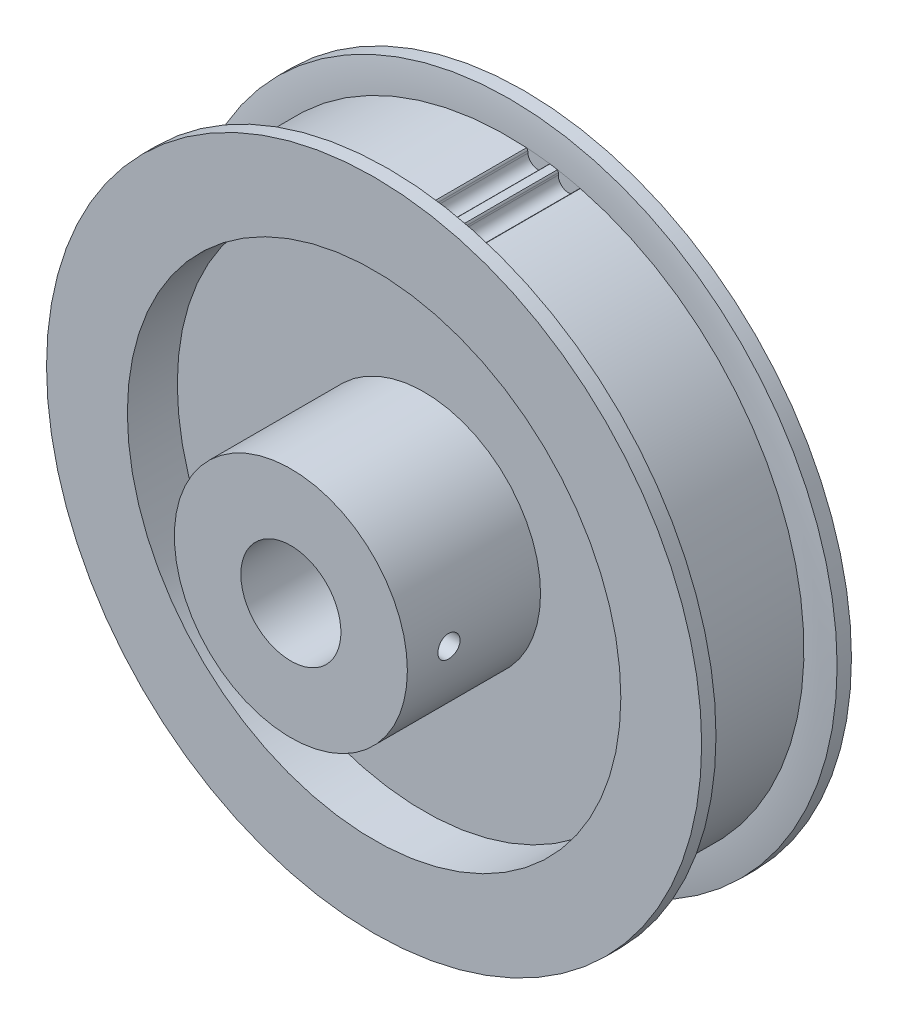
ISO-10303-21;
HEADER;
FILE_DESCRIPTION(('STEP AP214'),'2;1');
FILE_NAME('part.step','',(''),(''),'','','');
FILE_SCHEMA(('AUTOMOTIVE_DESIGN { 1 0 10303 214 1 1 1 1 }'));
ENDSEC;
DATA;
#1=APPLICATION_CONTEXT('core data for automotive mechanical design processes');
#2=APPLICATION_PROTOCOL_DEFINITION('international standard','automotive_design',2000,#1);
#3=PRODUCT_CONTEXT('',#1,'mechanical');
#4=PRODUCT('Part','Part','',(#3));
#5=PRODUCT_RELATED_PRODUCT_CATEGORY('part','',(#4));
#6=PRODUCT_DEFINITION_FORMATION('','',#4);
#7=PRODUCT_DEFINITION_CONTEXT('part definition',#1,'design');
#8=PRODUCT_DEFINITION('design','',#6,#7);
#9=PRODUCT_DEFINITION_SHAPE('','',#8);
#10=(LENGTH_UNIT() NAMED_UNIT(*) SI_UNIT(.MILLI.,.METRE.));
#11=(NAMED_UNIT(*) PLANE_ANGLE_UNIT() SI_UNIT($,.RADIAN.));
#12=(NAMED_UNIT(*) SI_UNIT($,.STERADIAN.) SOLID_ANGLE_UNIT());
#13=UNCERTAINTY_MEASURE_WITH_UNIT(LENGTH_MEASURE(1.E-05),#10,'distance_accuracy_value','');
#14=(GEOMETRIC_REPRESENTATION_CONTEXT(3) GLOBAL_UNCERTAINTY_ASSIGNED_CONTEXT((#13)) GLOBAL_UNIT_ASSIGNED_CONTEXT((#10,
#11,#12)) REPRESENTATION_CONTEXT('',''));
#15=CARTESIAN_POINT('',(0.,0.,0.));
#16=DIRECTION('',(0.,0.,1.));
#17=DIRECTION('',(1.,0.,0.));
#18=AXIS2_PLACEMENT_3D('',#15,#16,#17);
#19=CARTESIAN_POINT('',(0.,0.,15.08125));
#20=DIRECTION('',(0.,0.,-1.));
#21=DIRECTION('',(-1.,0.,0.));
#22=AXIS2_PLACEMENT_3D('',#19,#20,#21);
#23=CYLINDRICAL_SURFACE('',#22,4.76885);
#24=CARTESIAN_POINT('',(0.,0.,15.08125));
#25=DIRECTION('',(0.,0.,-1.));
#26=DIRECTION('',(-1.,0.,0.));
#27=AXIS2_PLACEMENT_3D('',#24,#25,#26);
#28=CIRCLE('',#27,4.76885);
#29=CARTESIAN_POINT('',(-4.76885,0.,15.08125));
#30=VERTEX_POINT('',#29);
#31=EDGE_CURVE('E20',#30,#30,#28,.T.);
#32=ORIENTED_EDGE('',*,*,#31,.F.);
#33=EDGE_LOOP('',(#32));
#34=FACE_BOUND('',#33,.T.);
#35=CARTESIAN_POINT('',(0.,0.,-7.14375));
#36=DIRECTION('',(0.,0.,-1.));
#37=DIRECTION('',(-1.,0.,0.));
#38=AXIS2_PLACEMENT_3D('',#35,#36,#37);
#39=CIRCLE('',#38,4.76885);
#40=CARTESIAN_POINT('',(-4.76885,0.,-7.14375));
#41=VERTEX_POINT('',#40);
#42=EDGE_CURVE('E616',#41,#41,#39,.T.);
#43=ORIENTED_EDGE('',*,*,#42,.T.);
#44=EDGE_LOOP('',(#43));
#45=FACE_BOUND('',#44,.T.);
#46=CARTESIAN_POINT('',(4.76885,0.,12.1708333333334));
#47=CARTESIAN_POINT('',(4.76884847306571,-0.0586123041048064,12.17083044195));
#48=CARTESIAN_POINT('',(4.76775734312836,-0.117295795218659,12.1659430419181));
#49=CARTESIAN_POINT('',(4.76350613938723,-0.2330437076321,12.1465291246467));
#50=CARTESIAN_POINT('',(4.7603420522376,-0.290104763764251,12.1319839086684));
#51=CARTESIAN_POINT('',(4.75229742473407,-0.400844929684411,12.0937325411842));
#52=CARTESIAN_POINT('',(4.74741952972268,-0.454529102128736,12.0700405026863));
#53=CARTESIAN_POINT('',(4.73647435346353,-0.5571418424057,12.0142065699433));
#54=CARTESIAN_POINT('',(4.7304074297014,-0.606071833002247,11.9820672144251));
#55=CARTESIAN_POINT('',(4.71763463518445,-0.698620847249218,11.9096827759978));
#56=CARTESIAN_POINT('',(4.7109205925116,-0.742149896327489,11.8693240760116));
#57=CARTESIAN_POINT('',(4.69766728828876,-0.82188187530551,11.781888529202));
#58=CARTESIAN_POINT('',(4.6911280522598,-0.858083740483086,11.734810707707));
#59=CARTESIAN_POINT('',(4.67888518332514,-0.922526682545571,11.6346126124925));
#60=CARTESIAN_POINT('',(4.67319191418832,-0.950672408242291,11.5814296333453));
#61=CARTESIAN_POINT('',(4.66340206452208,-0.997591991340194,11.4709418717254));
#62=CARTESIAN_POINT('',(4.65930527391939,-1.0163670818716,11.4136376327267));
#63=CARTESIAN_POINT('',(4.65325483593039,-1.04371677040196,11.2975035268964));
#64=CARTESIAN_POINT('',(4.65126796129376,-1.05244970180919,11.238712716185));
#65=CARTESIAN_POINT('',(4.64956255865491,-1.05995957296108,11.1204693760151));
#66=CARTESIAN_POINT('',(4.64984374652198,-1.05873775978254,11.0610169303745));
#67=CARTESIAN_POINT('',(4.65261263193993,-1.04650016245331,10.9443190716094));
#68=CARTESIAN_POINT('',(4.65505876969299,-1.03566883929887,10.8870531788706));
#69=CARTESIAN_POINT('',(4.66181620645629,-1.00481198001847,10.7751717294144));
#70=CARTESIAN_POINT('',(4.6661276262592,-0.984785848446423,10.7205563445944));
#71=CARTESIAN_POINT('',(4.67617067171151,-0.935938960169094,10.6150088795935));
#72=CARTESIAN_POINT('',(4.681913658347,-0.907047401484529,10.5641106924875));
#73=CARTESIAN_POINT('',(4.69416531023992,-0.841341705001432,10.4678204452049));
#74=CARTESIAN_POINT('',(4.70067402857244,-0.804527017880904,10.4224287671439));
#75=CARTESIAN_POINT('',(4.71390095516389,-0.723052709932271,10.3373819616924));
#76=CARTESIAN_POINT('',(4.72062061373945,-0.678237657979727,10.2978758300807));
#77=CARTESIAN_POINT('',(4.73338440331373,-0.582520218827615,10.2268984926627));
#78=CARTESIAN_POINT('',(4.73942824011096,-0.531615200324313,10.1954307785756));
#79=CARTESIAN_POINT('',(4.75018068491062,-0.424963998075343,10.1413864817509));
#80=CARTESIAN_POINT('',(4.75488521292261,-0.369203683150195,10.1188369874257));
#81=CARTESIAN_POINT('',(4.76239148758987,-0.254627675271092,10.0835132015441));
#82=CARTESIAN_POINT('',(4.76519721448175,-0.195818653498635,10.0707184550667));
#83=CARTESIAN_POINT('',(4.76754649622475,-0.113788746429426,10.0600534469669));
#84=CARTESIAN_POINT('',(4.76803417109396,-0.0910930120307624,10.0578478943051));
#85=CARTESIAN_POINT('',(4.7686862203424,-0.0456017778238444,10.0549039403021));
#86=CARTESIAN_POINT('',(4.76885059413613,-0.0228062778349896,10.0541655416179));
#87=CARTESIAN_POINT('',(4.76884847306572,0.0586123041048063,10.05416955805));
#88=CARTESIAN_POINT('',(4.76775734312836,0.117295795218659,10.0590569580819));
#89=CARTESIAN_POINT('',(4.76350613938723,0.233043707632099,10.0784708753533));
#90=CARTESIAN_POINT('',(4.7603420522376,0.290104763764251,10.0930160913316));
#91=CARTESIAN_POINT('',(4.75229742473407,0.400844929684412,10.1312674588158));
#92=CARTESIAN_POINT('',(4.74741952972267,0.454529102128737,10.1549594973137));
#93=CARTESIAN_POINT('',(4.73647435346353,0.557141842405701,10.2107934300567));
#94=CARTESIAN_POINT('',(4.7304074297014,0.606071833002247,10.2429327855749));
#95=CARTESIAN_POINT('',(4.71763463518445,0.698620847249218,10.3153172240022));
#96=CARTESIAN_POINT('',(4.7109205925116,0.742149896327489,10.3556759239884));
#97=CARTESIAN_POINT('',(4.69766728828876,0.82188187530551,10.443111470798));
#98=CARTESIAN_POINT('',(4.6911280522598,0.858083740483086,10.490189292293));
#99=CARTESIAN_POINT('',(4.67888518332514,0.922526682545571,10.5903873875075));
#100=CARTESIAN_POINT('',(4.67319191418832,0.95067240824229,10.6435703666547));
#101=CARTESIAN_POINT('',(4.66340206452208,0.997591991340194,10.7540581282746));
#102=CARTESIAN_POINT('',(4.65930527391939,1.0163670818716,10.8113623672733));
#103=CARTESIAN_POINT('',(4.65325483593039,1.04371677040196,10.9274964731036));
#104=CARTESIAN_POINT('',(4.65126796129376,1.05244970180919,10.986287283815));
#105=CARTESIAN_POINT('',(4.64956255865491,1.05995957296108,11.1045306239849));
#106=CARTESIAN_POINT('',(4.64984374652198,1.05873775978254,11.1639830696255));
#107=CARTESIAN_POINT('',(4.65261263193993,1.04650016245331,11.2806809283906));
#108=CARTESIAN_POINT('',(4.65505876969299,1.03566883929887,11.3379468211294));
#109=CARTESIAN_POINT('',(4.66181620645629,1.00481198001847,11.4498282705856));
#110=CARTESIAN_POINT('',(4.6661276262592,0.984785848446423,11.5044436554056));
#111=CARTESIAN_POINT('',(4.67617067171151,0.935938960169094,11.6099911204065));
#112=CARTESIAN_POINT('',(4.681913658347,0.907047401484529,11.6608893075125));
#113=CARTESIAN_POINT('',(4.69416531023991,0.841341705001432,11.7571795547951));
#114=CARTESIAN_POINT('',(4.70067402857244,0.804527017880904,11.8025712328561));
#115=CARTESIAN_POINT('',(4.71390095516389,0.723052709932272,11.8876180383076));
#116=CARTESIAN_POINT('',(4.72062061373945,0.678237657979727,11.9271241699193));
#117=CARTESIAN_POINT('',(4.73338440331373,0.582520218827616,11.9981015073373));
#118=CARTESIAN_POINT('',(4.73942824011096,0.531615200324313,12.0295692214244));
#119=CARTESIAN_POINT('',(4.75018068491062,0.424963998075343,12.0836135182491));
#120=CARTESIAN_POINT('',(4.75488521292261,0.369203683150194,12.1061630125743));
#121=CARTESIAN_POINT('',(4.76239148758987,0.254627675271092,12.1414867984559));
#122=CARTESIAN_POINT('',(4.76519721448175,0.195818653498635,12.1542815449333));
#123=CARTESIAN_POINT('',(4.76754649622475,0.113788746429426,12.1649465530331));
#124=CARTESIAN_POINT('',(4.76803417109396,0.0910930120307626,12.1671521056949));
#125=CARTESIAN_POINT('',(4.7686862203424,0.0456017778238447,12.1700960596979));
#126=CARTESIAN_POINT('',(4.76885059413613,0.0228062778349899,12.1708344583821));
#127=CARTESIAN_POINT('',(4.76885,0.,12.1708333333334));
#128=B_SPLINE_CURVE_WITH_KNOTS('',3,(#46,#47,#48,#49,#50,#51,#52,#53,#54,#55,#56,#57,#58,#59,
#60,#61,#62,#63,#64,#65,#66,#67,#68,#69,#70,#71,#72,#73,#74,#75,#76,#77,#78,#79,#80,#81,#82,#83,
#84,#85,#86,#87,#88,#89,#90,#91,#92,#93,#94,#95,#96,#97,#98,#99,#100,#101,#102,#103,#104,#105,
#106,#107,#108,#109,#110,#111,#112,#113,#114,#115,#116,#117,#118,#119,#120,#121,#122,#123,#124,
#125,#126,#127),.UNSPECIFIED.,.T.,.F.,(4,2,2,2,2,2,2,2,2,2,2,2,2,2,2,2,2,2,2,2,2,2,2,2,2,2,2,2,
2,2,2,2,2,2,2,2,2,2,2,2,4),(0.,0.175749615830444,0.351840500975271,0.527660767156468,
0.703428253231945,0.881814109226019,1.06022586810902,1.24066935647048,1.42108909307747,
1.59862339281777,1.77613545235915,1.95031204400599,2.12449991673606,2.30011680096918,
2.47574586490048,2.65525742576131,2.83484683057527,3.0149776104805,3.19472962378812,
3.26311436604358,3.33149923214361,3.50724884797406,3.68333973311889,3.85915999930008,
4.03492748537556,4.21331334136963,4.39172510025263,4.57216858861409,4.75258832522109,
4.93012262496138,5.10763468450276,5.2818112761496,5.45599914887968,5.6316160331128,
5.80724509704409,5.98675665790492,6.16634606271888,6.34647684262411,6.52622885593174,
6.59461359818719,6.66299846428723),.UNSPECIFIED.);
#129=CARTESIAN_POINT('',(4.76885,0.,12.1708333333334));
#130=VERTEX_POINT('',#129);
#131=EDGE_CURVE('E619',#130,#130,#128,.T.);
#132=ORIENTED_EDGE('',*,*,#131,.T.);
#133=EDGE_LOOP('',(#132));
#134=FACE_BOUND('',#133,.T.);
#135=ADVANCED_FACE('F16',(#34,#45,#134),#23,.F.);
#136=CARTESIAN_POINT('',(0.,0.,15.08125));
#137=DIRECTION('',(0.,0.,1.));
#138=DIRECTION('',(1.,0.,0.));
#139=AXIS2_PLACEMENT_3D('',#136,#137,#138);
#140=PLANE('',#139);
#141=ORIENTED_EDGE('',*,*,#31,.T.);
#142=EDGE_LOOP('',(#141));
#143=FACE_BOUND('',#142,.T.);
#144=CARTESIAN_POINT('',(0.,0.,15.08125));
#145=DIRECTION('',(0.,0.,1.));
#146=DIRECTION('',(1.,0.,0.));
#147=AXIS2_PLACEMENT_3D('',#144,#145,#146);
#148=CIRCLE('',#147,11.1125);
#149=CARTESIAN_POINT('',(11.1125,0.,15.08125));
#150=VERTEX_POINT('',#149);
#151=EDGE_CURVE('E250',#150,#150,#148,.F.);
#152=ORIENTED_EDGE('',*,*,#151,.F.);
#153=EDGE_LOOP('',(#152));
#154=FACE_BOUND('',#153,.T.);
#155=ADVANCED_FACE('F269',(#143,#154),#140,.T.);
#156=CARTESIAN_POINT('',(0.,0.,11.1125));
#157=DIRECTION('',(-1.,0.,0.));
#158=DIRECTION('',(0.,0.,1.));
#159=AXIS2_PLACEMENT_3D('',#156,#157,#158);
#160=CYLINDRICAL_SURFACE('',#159,1.05833333333342);
#161=ORIENTED_EDGE('',*,*,#131,.F.);
#162=EDGE_LOOP('',(#161));
#163=FACE_BOUND('',#162,.T.);
#164=CARTESIAN_POINT('',(11.1125,0.,10.0541666666666));
#165=CARTESIAN_POINT('',(11.1124989638523,-0.0592671550999744,10.0541714540668));
#166=CARTESIAN_POINT('',(11.1120206208282,-0.118584544200863,10.0591635092179));
#167=CARTESIAN_POINT('',(11.1101565200235,-0.235630334602228,10.0790184258732));
#168=CARTESIAN_POINT('',(11.1087688521852,-0.293355124043965,10.093902065816));
#169=CARTESIAN_POINT('',(11.1052431819375,-0.405425493440314,10.1331030809392));
#170=CARTESIAN_POINT('',(11.1031059087191,-0.459774297178893,10.1574112906278));
#171=CARTESIAN_POINT('',(11.0983206357579,-0.563594837914847,10.2147548282555));
#172=CARTESIAN_POINT('',(11.0956728607508,-0.613068706553428,10.2477863183431));
#173=CARTESIAN_POINT('',(11.0901530073947,-0.705929242623906,10.3217614117352));
#174=CARTESIAN_POINT('',(11.0872802783227,-0.749297152851714,10.3627285149114));
#175=CARTESIAN_POINT('',(11.0816395852796,-0.828554895579713,10.4513637308074));
#176=CARTESIAN_POINT('',(11.0788716311944,-0.864444023858242,10.499032473864));
#177=CARTESIAN_POINT('',(11.0737475705315,-0.927785738639724,10.5998279840321));
#178=CARTESIAN_POINT('',(11.0713922559129,-0.955222177184333,10.6529649425153));
#179=CARTESIAN_POINT('',(11.0673677624902,-1.00077625106514,10.7631173073537));
#180=CARTESIAN_POINT('',(11.0656985622257,-1.01889417787304,10.8201325923364));
#181=CARTESIAN_POINT('',(11.0632408497598,-1.04524377560842,10.9362392823233));
#182=CARTESIAN_POINT('',(11.0624496683685,-1.05350541556563,10.995323828622));
#183=CARTESIAN_POINT('',(11.0618292482857,-1.06000054026498,11.1140459311561));
#184=CARTESIAN_POINT('',(11.0619999882178,-1.05823424785272,11.1736834750731));
#185=CARTESIAN_POINT('',(11.0632816825826,-1.04474839497381,11.2916117994292));
#186=CARTESIAN_POINT('',(11.0643895416912,-1.03306160168072,11.3499063653701));
#187=CARTESIAN_POINT('',(11.0674158220506,-1.00011727524658,11.4637033798779));
#188=CARTESIAN_POINT('',(11.0693342607473,-0.978859536112667,11.5192057683209));
#189=CARTESIAN_POINT('',(11.0737691809829,-0.927339550973742,11.6259479297947));
#190=CARTESIAN_POINT('',(11.0762866503851,-0.89706241004613,11.6771804709455));
#191=CARTESIAN_POINT('',(11.0816348512314,-0.828376587534368,11.7738448319784));
#192=CARTESIAN_POINT('',(11.0844655650076,-0.789968364457045,11.8192769787097));
#193=CARTESIAN_POINT('',(11.0901347397117,-0.705934814809366,11.903238132352));
#194=CARTESIAN_POINT('',(11.0929731891309,-0.660282581488272,11.9417402132193));
#195=CARTESIAN_POINT('',(11.0983291739985,-0.563124310775004,12.0105563316129));
#196=CARTESIAN_POINT('',(11.100846560153,-0.511615571019497,12.04086656722));
#197=CARTESIAN_POINT('',(11.1052778699882,-0.404169772358272,12.0924350310275));
#198=CARTESIAN_POINT('',(11.1071912033874,-0.348228448275424,12.113684412009));
#199=CARTESIAN_POINT('',(11.1101905600753,-0.233641506069249,12.1464335634387));
#200=CARTESIAN_POINT('',(11.1112783381809,-0.175001906658918,12.1579540197964));
#201=CARTESIAN_POINT('',(11.1122977915828,-0.0773879058659506,12.168712617274));
#202=CARTESIAN_POINT('',(11.1125006766606,-0.0387046648261569,12.1708364597652));
#203=CARTESIAN_POINT('',(11.1124989638523,0.0592671550999725,12.1708285459332));
#204=CARTESIAN_POINT('',(11.1120206208282,0.118584544200862,12.1658364907821));
#205=CARTESIAN_POINT('',(11.1101565200235,0.235630334602226,12.1459815741268));
#206=CARTESIAN_POINT('',(11.1087688521852,0.293355124043963,12.131097934184));
#207=CARTESIAN_POINT('',(11.1052431819375,0.405425493440313,12.0918969190608));
#208=CARTESIAN_POINT('',(11.1031059087191,0.459774297178892,12.0675887093722));
#209=CARTESIAN_POINT('',(11.0983206357579,0.563594837914846,12.0102451717445));
#210=CARTESIAN_POINT('',(11.0956728607508,0.613068706553428,11.9772136816569));
#211=CARTESIAN_POINT('',(11.0901530073947,0.705929242623905,11.9032385882648));
#212=CARTESIAN_POINT('',(11.0872802783227,0.749297152851714,11.8622714850886));
#213=CARTESIAN_POINT('',(11.0816395852796,0.828554895579712,11.7736362691926));
#214=CARTESIAN_POINT('',(11.0788716311944,0.864444023858242,11.725967526136));
#215=CARTESIAN_POINT('',(11.0737475705315,0.927785738639723,11.6251720159679));
#216=CARTESIAN_POINT('',(11.0713922559129,0.955222177184332,11.5720350574847));
#217=CARTESIAN_POINT('',(11.0673677624902,1.00077625106514,11.4618826926463));
#218=CARTESIAN_POINT('',(11.0656985622257,1.01889417787304,11.4048674076636));
#219=CARTESIAN_POINT('',(11.0632408497598,1.04524377560842,11.2887607176767));
#220=CARTESIAN_POINT('',(11.0624496683685,1.05350541556563,11.229676171378));
#221=CARTESIAN_POINT('',(11.0618292482857,1.06000054026498,11.1109540688439));
#222=CARTESIAN_POINT('',(11.0619999882178,1.05823424785272,11.0513165249269));
#223=CARTESIAN_POINT('',(11.0632816825826,1.04474839497381,10.9333882005708));
#224=CARTESIAN_POINT('',(11.0643895416912,1.03306160168072,10.8750936346299));
#225=CARTESIAN_POINT('',(11.0674158220506,1.00011727524658,10.7612966201221));
#226=CARTESIAN_POINT('',(11.0693342607473,0.978859536112667,10.7057942316791));
#227=CARTESIAN_POINT('',(11.0737691809829,0.927339550973742,10.5990520702053));
#228=CARTESIAN_POINT('',(11.0762866503851,0.897062410046131,10.5478195290545));
#229=CARTESIAN_POINT('',(11.0816348512314,0.828376587534369,10.4511551680216));
#230=CARTESIAN_POINT('',(11.0844655650076,0.789968364457046,10.4057230212903));
#231=CARTESIAN_POINT('',(11.0901347397117,0.705934814809367,10.321761867648));
#232=CARTESIAN_POINT('',(11.0929731891309,0.660282581488274,10.2832597867807));
#233=CARTESIAN_POINT('',(11.0983291739985,0.563124310775006,10.2144436683871));
#234=CARTESIAN_POINT('',(11.100846560153,0.511615571019499,10.18413343278));
#235=CARTESIAN_POINT('',(11.1052778699882,0.404169772358273,10.1325649689725));
#236=CARTESIAN_POINT('',(11.1071912033874,0.348228448275425,10.111315587991));
#237=CARTESIAN_POINT('',(11.1101905600753,0.23364150606925,10.0785664365613));
#238=CARTESIAN_POINT('',(11.1112783381809,0.17500190665892,10.0670459802036));
#239=CARTESIAN_POINT('',(11.1122977915828,0.0773879058659508,10.056287382726));
#240=CARTESIAN_POINT('',(11.1125006766606,0.0387046648261561,10.0541635402348));
#241=CARTESIAN_POINT('',(11.1125,0.,10.0541666666666));
#242=B_SPLINE_CURVE_WITH_KNOTS('',3,(#164,#165,#166,#167,#168,#169,#170,#171,#172,#173,#174,
#175,#176,#177,#178,#179,#180,#181,#182,#183,#184,#185,#186,#187,#188,#189,#190,#191,#192,#193,
#194,#195,#196,#197,#198,#199,#200,#201,#202,#203,#204,#205,#206,#207,#208,#209,#210,#211,#212,
#213,#214,#215,#216,#217,#218,#219,#220,#221,#222,#223,#224,#225,#226,#227,#228,#229,#230,#231,
#232,#233,#234,#235,#236,#237,#238,#239,#240,#241),.UNSPECIFIED.,.T.,.F.,(4,2,2,2,2,2,2,2,2,2,2,
2,2,2,2,2,2,2,2,2,2,2,2,2,2,2,2,2,2,2,2,2,2,2,2,2,2,2,4),(0.,0.17767848080587,0.355731380887713,
0.533611555268287,0.711413600359596,0.889750453398903,1.06810409152203,1.24679637206856,
1.42548306299802,1.60362504299602,1.7817630642513,1.9593149791827,2.13687071569815,
2.31472131436022,2.49256188680419,2.67107918749631,2.84967919817254,3.02845320072284,
3.20684612507444,3.32287980401198,3.50055828481785,3.67861118489969,3.85649135928027,
4.03429340437158,4.21263025741088,4.390983895534,4.56967617608054,4.74836286701,4.926504847008,
5.10464286826328,5.28219478319468,5.45975051971012,5.6376011183722,5.81544169081616,
5.99395899150829,6.17255900218452,6.35133300473481,6.52972592908641,6.64575960802396),.UNSPECIFIED.);
#243=CARTESIAN_POINT('',(11.1125,0.,10.0541666666666));
#244=VERTEX_POINT('',#243);
#245=EDGE_CURVE('E243',#244,#244,#242,.T.);
#246=ORIENTED_EDGE('',*,*,#245,.F.);
#247=EDGE_LOOP('',(#246));
#248=FACE_BOUND('',#247,.T.);
#249=ADVANCED_FACE('F252',(#163,#248),#160,.F.);
#250=CARTESIAN_POINT('',(0.,0.,-7.14375));
#251=DIRECTION('',(0.,0.,1.));
#252=DIRECTION('',(1.,0.,0.));
#253=AXIS2_PLACEMENT_3D('',#250,#251,#252);
#254=PLANE('',#253);
#255=ORIENTED_EDGE('',*,*,#42,.F.);
#256=EDGE_LOOP('',(#255));
#257=FACE_BOUND('',#256,.T.);
#258=CARTESIAN_POINT('',(0.,0.,-7.14375));
#259=DIRECTION('',(0.,0.,1.));
#260=DIRECTION('',(1.,0.,0.));
#261=AXIS2_PLACEMENT_3D('',#258,#259,#260);
#262=CIRCLE('',#261,11.1125);
#263=CARTESIAN_POINT('',(11.1125,0.,-7.14375));
#264=VERTEX_POINT('',#263);
#265=EDGE_CURVE('E150',#264,#264,#262,.T.);
#266=ORIENTED_EDGE('',*,*,#265,.F.);
#267=EDGE_LOOP('',(#266));
#268=FACE_BOUND('',#267,.T.);
#269=ADVANCED_FACE('F260',(#257,#268),#254,.F.);
#270=CARTESIAN_POINT('',(0.,0.,7.14375));
#271=DIRECTION('',(0.,0.,1.));
#272=DIRECTION('',(1.,0.,0.));
#273=AXIS2_PLACEMENT_3D('',#270,#271,#272);
#274=CYLINDRICAL_SURFACE('',#273,11.1125);
#275=ORIENTED_EDGE('',*,*,#151,.T.);
#276=EDGE_LOOP('',(#275));
#277=FACE_BOUND('',#276,.T.);
#278=CARTESIAN_POINT('',(0.,0.,2.38125));
#279=DIRECTION('',(0.,0.,1.));
#280=DIRECTION('',(1.,0.,0.));
#281=AXIS2_PLACEMENT_3D('',#278,#279,#280);
#282=CIRCLE('',#281,11.1125);
#283=CARTESIAN_POINT('',(11.1125,0.,2.38125));
#284=VERTEX_POINT('',#283);
#285=EDGE_CURVE('E155',#284,#284,#282,.F.);
#286=ORIENTED_EDGE('',*,*,#285,.F.);
#287=EDGE_LOOP('',(#286));
#288=FACE_BOUND('',#287,.T.);
#289=ORIENTED_EDGE('',*,*,#245,.T.);
#290=EDGE_LOOP('',(#289));
#291=FACE_BOUND('',#290,.T.);
#292=ADVANCED_FACE('F255',(#277,#288,#291),#274,.T.);
#293=CARTESIAN_POINT('',(0.,0.,-7.14375));
#294=DIRECTION('',(0.,0.,1.));
#295=DIRECTION('',(1.,0.,0.));
#296=AXIS2_PLACEMENT_3D('',#293,#294,#295);
#297=CYLINDRICAL_SURFACE('',#296,11.1125);
#298=CARTESIAN_POINT('',(0.,0.,-2.38125));
#299=DIRECTION('',(0.,0.,1.));
#300=DIRECTION('',(1.,0.,0.));
#301=AXIS2_PLACEMENT_3D('',#298,#299,#300);
#302=CIRCLE('',#301,11.1125);
#303=CARTESIAN_POINT('',(11.1125,0.,-2.38125));
#304=VERTEX_POINT('',#303);
#305=EDGE_CURVE('E117',#304,#304,#302,.F.);
#306=ORIENTED_EDGE('',*,*,#305,.T.);
#307=EDGE_LOOP('',(#306));
#308=FACE_BOUND('',#307,.T.);
#309=ORIENTED_EDGE('',*,*,#265,.T.);
#310=EDGE_LOOP('',(#309));
#311=FACE_BOUND('',#310,.T.);
#312=ADVANCED_FACE('F259',(#308,#311),#297,.T.);
#313=CARTESIAN_POINT('',(0.,0.,-5.55625));
#314=DIRECTION('',(0.,0.,1.));
#315=DIRECTION('',(1.,0.,0.));
#316=AXIS2_PLACEMENT_3D('',#313,#314,#315);
#317=CYLINDRICAL_SURFACE('',#316,28.2956);
#318=CARTESIAN_POINT('',(0.,0.,5.55625));
#319=DIRECTION('',(0.,0.,1.));
#320=DIRECTION('',(1.,0.,0.));
#321=AXIS2_PLACEMENT_3D('',#318,#319,#320);
#322=CIRCLE('',#321,28.2956);
#323=CARTESIAN_POINT('',(4.06457700924027,28.002146223027,5.55625));
#324=VERTEX_POINT('',#323);
#325=CARTESIAN_POINT('',(4.78749661126617,27.88764700646,5.55625));
#326=VERTEX_POINT('',#325);
#327=EDGE_CURVE('E149',#324,#326,#322,.F.);
#328=ORIENTED_EDGE('',*,*,#327,.T.);
#329=DIRECTION('',(0.,0.,1.));
#330=VECTOR('',#329,1.);
#331=CARTESIAN_POINT('',(4.78749661126491,27.8876470064573,5.55625));
#332=LINE('',#331,#330);
#333=CARTESIAN_POINT('',(4.787496611266,27.8876470064591,-5.55625));
#334=VERTEX_POINT('',#333);
#335=EDGE_CURVE('E140',#334,#326,#332,.T.);
#336=ORIENTED_EDGE('',*,*,#335,.F.);
#337=CARTESIAN_POINT('',(0.,0.,-5.55625));
#338=DIRECTION('',(0.,0.,1.));
#339=DIRECTION('',(1.,0.,0.));
#340=AXIS2_PLACEMENT_3D('',#337,#338,#339);
#341=CIRCLE('',#340,28.2956);
#342=CARTESIAN_POINT('',(4.06457700924036,28.0021462230276,-5.55625));
#343=VERTEX_POINT('',#342);
#344=EDGE_CURVE('E146',#334,#343,#341,.T.);
#345=ORIENTED_EDGE('',*,*,#344,.T.);
#346=DIRECTION('',(0.,0.,1.));
#347=VECTOR('',#346,1.);
#348=CARTESIAN_POINT('',(4.06457700924127,28.0021462230246,5.55625));
#349=LINE('',#348,#347);
#350=EDGE_CURVE('E114',#324,#343,#349,.F.);
#351=ORIENTED_EDGE('',*,*,#350,.F.);
#352=EDGE_LOOP('',(#328,#336,#345,#351));
#353=FACE_BOUND('',#352,.T.);
#354=ADVANCED_FACE('F441',(#353),#317,.T.);
#355=CARTESIAN_POINT('',(0.,0.,2.38125));
#356=DIRECTION('',(0.,0.,1.));
#357=DIRECTION('',(1.,0.,0.));
#358=AXIS2_PLACEMENT_3D('',#355,#356,#357);
#359=PLANE('',#358);
#360=ORIENTED_EDGE('',*,*,#285,.T.);
#361=EDGE_LOOP('',(#360));
#362=FACE_BOUND('',#361,.T.);
#363=CARTESIAN_POINT('',(0.,0.,2.38125));
#364=DIRECTION('',(0.,0.,1.));
#365=DIRECTION('',(1.,0.,0.));
#366=AXIS2_PLACEMENT_3D('',#363,#364,#365);
#367=CIRCLE('',#366,23.5331);
#368=CARTESIAN_POINT('',(23.5331,0.,2.38125));
#369=VERTEX_POINT('',#368);
#370=EDGE_CURVE('E134',#369,#369,#367,.T.);
#371=ORIENTED_EDGE('',*,*,#370,.T.);
#372=EDGE_LOOP('',(#371));
#373=FACE_BOUND('',#372,.T.);
#374=ADVANCED_FACE('F438',(#362,#373),#359,.T.);
#375=CARTESIAN_POINT('',(0.,0.,-2.38125));
#376=DIRECTION('',(0.,0.,1.));
#377=DIRECTION('',(1.,0.,0.));
#378=AXIS2_PLACEMENT_3D('',#375,#376,#377);
#379=PLANE('',#378);
#380=ORIENTED_EDGE('',*,*,#305,.F.);
#381=EDGE_LOOP('',(#380));
#382=FACE_BOUND('',#381,.T.);
#383=CARTESIAN_POINT('',(0.,0.,-2.38125));
#384=DIRECTION('',(0.,0.,1.));
#385=DIRECTION('',(1.,0.,0.));
#386=AXIS2_PLACEMENT_3D('',#383,#384,#385);
#387=CIRCLE('',#386,23.5331);
#388=CARTESIAN_POINT('',(23.5331,0.,-2.38125));
#389=VERTEX_POINT('',#388);
#390=EDGE_CURVE('E131',#389,#389,#387,.F.);
#391=ORIENTED_EDGE('',*,*,#390,.T.);
#392=EDGE_LOOP('',(#391));
#393=FACE_BOUND('',#392,.T.);
#394=ADVANCED_FACE('F435',(#382,#393),#379,.F.);
#395=CARTESIAN_POINT('',(4.20564072847312,27.7376975408262,5.55625));
#396=DIRECTION('',(0.,0.,1.));
#397=DIRECTION('',(1.,0.,0.));
#398=AXIS2_PLACEMENT_3D('',#395,#396,#397);
#399=CYLINDRICAL_SURFACE('',#398,0.29972);
#400=CARTESIAN_POINT('',(4.20564072847312,27.7376975408262,5.55625));
#401=DIRECTION('',(0.,0.,1.));
#402=DIRECTION('',(1.,0.,0.));
#403=AXIS2_PLACEMENT_3D('',#400,#401,#402);
#404=CIRCLE('',#403,0.29972);
#405=CARTESIAN_POINT('',(3.92047908940835,27.8299738541831,5.55625));
#406=VERTEX_POINT('',#405);
#407=EDGE_CURVE('E102',#406,#324,#404,.F.);
#408=ORIENTED_EDGE('',*,*,#407,.T.);
#409=ORIENTED_EDGE('',*,*,#350,.T.);
#410=CARTESIAN_POINT('',(4.20564072847312,27.7376975408262,-5.55625));
#411=DIRECTION('',(0.,0.,1.));
#412=DIRECTION('',(1.,0.,0.));
#413=AXIS2_PLACEMENT_3D('',#410,#411,#412);
#414=CIRCLE('',#413,0.29972);
#415=CARTESIAN_POINT('',(3.92047908940835,27.8299738541831,-5.55625));
#416=VERTEX_POINT('',#415);
#417=EDGE_CURVE('E107',#343,#416,#414,.T.);
#418=ORIENTED_EDGE('',*,*,#417,.T.);
#419=DIRECTION('',(0.,0.,1.));
#420=VECTOR('',#419,1.);
#421=CARTESIAN_POINT('',(3.92047908940903,27.8299738541898,5.55625));
#422=LINE('',#421,#420);
#423=EDGE_CURVE('E111',#406,#416,#422,.F.);
#424=ORIENTED_EDGE('',*,*,#423,.F.);
#425=EDGE_LOOP('',(#408,#409,#418,#424));
#426=FACE_BOUND('',#425,.T.);
#427=ADVANCED_FACE('F109',(#426),#399,.T.);
#428=CARTESIAN_POINT('',(4.57161790493742,27.679732450559,5.55625));
#429=DIRECTION('',(0.,0.,1.));
#430=DIRECTION('',(1.,0.,0.));
#431=AXIS2_PLACEMENT_3D('',#428,#429,#430);
#432=CYLINDRICAL_SURFACE('',#431,0.29972);
#433=CARTESIAN_POINT('',(4.57161790493742,27.679732450559,-5.55625));
#434=DIRECTION('',(0.,0.,1.));
#435=DIRECTION('',(1.,0.,0.));
#436=AXIS2_PLACEMENT_3D('',#433,#434,#435);
#437=CIRCLE('',#436,0.29972);
#438=CARTESIAN_POINT('',(4.87133768897263,27.6793726470587,-5.55625));
#439=VERTEX_POINT('',#438);
#440=EDGE_CURVE('E143',#439,#334,#437,.T.);
#441=ORIENTED_EDGE('',*,*,#440,.T.);
#442=ORIENTED_EDGE('',*,*,#335,.T.);
#443=CARTESIAN_POINT('',(4.57161790493742,27.679732450559,5.55625));
#444=DIRECTION('',(0.,0.,1.));
#445=DIRECTION('',(1.,0.,0.));
#446=AXIS2_PLACEMENT_3D('',#443,#444,#445);
#447=CIRCLE('',#446,0.29972);
#448=CARTESIAN_POINT('',(4.87133768897263,27.6793726470587,5.55625));
#449=VERTEX_POINT('',#448);
#450=EDGE_CURVE('E159',#326,#449,#447,.F.);
#451=ORIENTED_EDGE('',*,*,#450,.T.);
#452=DIRECTION('',(0.,0.,1.));
#453=VECTOR('',#452,1.);
#454=CARTESIAN_POINT('',(4.87133768897375,27.6793726470622,5.55625));
#455=LINE('',#454,#453);
#456=EDGE_CURVE('E138',#439,#449,#455,.T.);
#457=ORIENTED_EDGE('',*,*,#456,.F.);
#458=EDGE_LOOP('',(#441,#442,#451,#457));
#459=FACE_BOUND('',#458,.T.);
#460=ADVANCED_FACE('F428',(#459),#432,.T.);
#461=CARTESIAN_POINT('',(0.,0.,7.14375));
#462=DIRECTION('',(0.,0.,1.));
#463=DIRECTION('',(1.,0.,0.));
#464=AXIS2_PLACEMENT_3D('',#461,#462,#463);
#465=CYLINDRICAL_SURFACE('',#464,23.5331);
#466=ORIENTED_EDGE('',*,*,#370,.F.);
#467=EDGE_LOOP('',(#466));
#468=FACE_BOUND('',#467,.T.);
#469=CARTESIAN_POINT('',(0.,0.,7.14375));
#470=DIRECTION('',(0.,0.,1.));
#471=DIRECTION('',(1.,0.,0.));
#472=AXIS2_PLACEMENT_3D('',#469,#470,#471);
#473=CIRCLE('',#472,23.5331);
#474=CARTESIAN_POINT('',(23.5331,0.,7.14375));
#475=VERTEX_POINT('',#474);
#476=EDGE_CURVE('E214',#475,#475,#473,.F.);
#477=ORIENTED_EDGE('',*,*,#476,.F.);
#478=EDGE_LOOP('',(#477));
#479=FACE_BOUND('',#478,.T.);
#480=ADVANCED_FACE('F424',(#468,#479),#465,.F.);
#481=CARTESIAN_POINT('',(0.,0.,-7.14375));
#482=DIRECTION('',(0.,0.,1.));
#483=DIRECTION('',(1.,0.,0.));
#484=AXIS2_PLACEMENT_3D('',#481,#482,#483);
#485=CYLINDRICAL_SURFACE('',#484,23.5331);
#486=ORIENTED_EDGE('',*,*,#390,.F.);
#487=EDGE_LOOP('',(#486));
#488=FACE_BOUND('',#487,.T.);
#489=CARTESIAN_POINT('',(0.,0.,-7.14375));
#490=DIRECTION('',(0.,0.,1.));
#491=DIRECTION('',(1.,0.,0.));
#492=AXIS2_PLACEMENT_3D('',#489,#490,#491);
#493=CIRCLE('',#492,23.5331);
#494=CARTESIAN_POINT('',(23.5331,0.,-7.14375));
#495=VERTEX_POINT('',#494);
#496=EDGE_CURVE('E210',#495,#495,#493,.F.);
#497=ORIENTED_EDGE('',*,*,#496,.T.);
#498=EDGE_LOOP('',(#497));
#499=FACE_BOUND('',#498,.T.);
#500=ADVANCED_FACE('F421',(#488,#499),#485,.F.);
#501=CARTESIAN_POINT('',(14.7952873588505,24.3109619043823,5.55625));
#502=DIRECTION('',(0.,0.,1.));
#503=DIRECTION('',(1.,0.,0.));
#504=AXIS2_PLACEMENT_3D('',#501,#502,#503);
#505=CYLINDRICAL_SURFACE('',#504,11.43);
#506=DIRECTION('',(0.,0.,1.));
#507=VECTOR('',#506,1.);
#508=CARTESIAN_POINT('',(3.86387946685401,27.6500069023893,5.55625));
#509=LINE('',#508,#507);
#510=CARTESIAN_POINT('',(3.86387946685075,27.6500069023847,-5.55625));
#511=VERTEX_POINT('',#510);
#512=CARTESIAN_POINT('',(3.86387946685075,27.6500069023847,5.55625));
#513=VERTEX_POINT('',#512);
#514=EDGE_CURVE('E213',#511,#513,#509,.T.);
#515=ORIENTED_EDGE('',*,*,#514,.T.);
#516=CARTESIAN_POINT('',(14.7952873588505,24.3109619043823,5.55625));
#517=DIRECTION('',(0.,0.,1.));
#518=DIRECTION('',(1.,0.,0.));
#519=AXIS2_PLACEMENT_3D('',#516,#517,#518);
#520=CIRCLE('',#519,11.43);
#521=EDGE_CURVE('E128',#513,#406,#520,.F.);
#522=ORIENTED_EDGE('',*,*,#521,.T.);
#523=ORIENTED_EDGE('',*,*,#423,.T.);
#524=CARTESIAN_POINT('',(14.7952873588505,24.3109619043823,-5.55625));
#525=DIRECTION('',(0.,0.,1.));
#526=DIRECTION('',(1.,0.,0.));
#527=AXIS2_PLACEMENT_3D('',#524,#525,#526);
#528=CIRCLE('',#527,11.43);
#529=EDGE_CURVE('E120',#416,#511,#528,.T.);
#530=ORIENTED_EDGE('',*,*,#529,.T.);
#531=EDGE_LOOP('',(#515,#522,#523,#530));
#532=FACE_BOUND('',#531,.T.);
#533=ADVANCED_FACE('F130',(#532),#505,.T.);
#534=CARTESIAN_POINT('',(-6.55865407503798,27.6930939671176,5.55625));
#535=DIRECTION('',(0.,0.,1.));
#536=DIRECTION('',(1.,0.,0.));
#537=AXIS2_PLACEMENT_3D('',#534,#535,#536);
#538=CYLINDRICAL_SURFACE('',#537,11.43);
#539=ORIENTED_EDGE('',*,*,#456,.T.);
#540=CARTESIAN_POINT('',(-6.55865407503798,27.6930939671176,5.55625));
#541=DIRECTION('',(0.,0.,1.));
#542=DIRECTION('',(1.,0.,0.));
#543=AXIS2_PLACEMENT_3D('',#540,#541,#542);
#544=CIRCLE('',#543,11.43);
#545=CARTESIAN_POINT('',(4.86955428229548,27.4907236595865,5.55625));
#546=VERTEX_POINT('',#545);
#547=EDGE_CURVE('E217',#449,#546,#544,.F.);
#548=ORIENTED_EDGE('',*,*,#547,.T.);
#549=DIRECTION('',(0.,0.,1.));
#550=VECTOR('',#549,1.);
#551=CARTESIAN_POINT('',(4.86955428229541,27.4907236595908,5.55625));
#552=LINE('',#551,#550);
#553=CARTESIAN_POINT('',(4.86955428229548,27.4907236595865,-5.55625));
#554=VERTEX_POINT('',#553);
#555=EDGE_CURVE('E207',#546,#554,#552,.F.);
#556=ORIENTED_EDGE('',*,*,#555,.T.);
#557=CARTESIAN_POINT('',(-6.55865407503798,27.6930939671176,-5.55625));
#558=DIRECTION('',(0.,0.,1.));
#559=DIRECTION('',(1.,0.,0.));
#560=AXIS2_PLACEMENT_3D('',#557,#558,#559);
#561=CIRCLE('',#560,11.43);
#562=EDGE_CURVE('E219',#554,#439,#561,.T.);
#563=ORIENTED_EDGE('',*,*,#562,.T.);
#564=EDGE_LOOP('',(#539,#548,#556,#563));
#565=FACE_BOUND('',#564,.T.);
#566=ADVANCED_FACE('F414',(#565),#538,.T.);
#567=CARTESIAN_POINT('',(0.,0.,7.14375));
#568=DIRECTION('',(0.,0.,1.));
#569=DIRECTION('',(1.,0.,0.));
#570=AXIS2_PLACEMENT_3D('',#567,#568,#569);
#571=PLANE('',#570);
#572=ORIENTED_EDGE('',*,*,#476,.T.);
#573=EDGE_LOOP('',(#572));
#574=FACE_BOUND('',#573,.T.);
#575=CARTESIAN_POINT('',(0.,0.,7.14375));
#576=DIRECTION('',(0.,0.,1.));
#577=DIRECTION('',(1.,0.,0.));
#578=AXIS2_PLACEMENT_3D('',#575,#576,#577);
#579=CIRCLE('',#578,31.242);
#580=CARTESIAN_POINT('',(31.242,0.,7.14375));
#581=VERTEX_POINT('',#580);
#582=EDGE_CURVE('E199',#581,#581,#579,.F.);
#583=ORIENTED_EDGE('',*,*,#582,.F.);
#584=EDGE_LOOP('',(#583));
#585=FACE_BOUND('',#584,.T.);
#586=ADVANCED_FACE('F410',(#574,#585),#571,.T.);
#587=CARTESIAN_POINT('',(0.,0.,-7.14375));
#588=DIRECTION('',(0.,0.,1.));
#589=DIRECTION('',(1.,0.,0.));
#590=AXIS2_PLACEMENT_3D('',#587,#588,#589);
#591=PLANE('',#590);
#592=ORIENTED_EDGE('',*,*,#496,.F.);
#593=EDGE_LOOP('',(#592));
#594=FACE_BOUND('',#593,.T.);
#595=CARTESIAN_POINT('',(0.,0.,-7.14375));
#596=DIRECTION('',(0.,0.,1.));
#597=DIRECTION('',(1.,0.,0.));
#598=AXIS2_PLACEMENT_3D('',#595,#596,#597);
#599=CIRCLE('',#598,31.242);
#600=CARTESIAN_POINT('',(31.242,0.,-7.14375));
#601=VERTEX_POINT('',#600);
#602=EDGE_CURVE('E186',#601,#601,#599,.T.);
#603=ORIENTED_EDGE('',*,*,#602,.F.);
#604=EDGE_LOOP('',(#603));
#605=FACE_BOUND('',#604,.T.);
#606=ADVANCED_FACE('F406',(#594,#605),#591,.F.);
#607=CARTESIAN_POINT('',(2.93592439690756,27.9334547222092,5.55625));
#608=DIRECTION('',(0.,0.,1.));
#609=DIRECTION('',(1.,0.,0.));
#610=AXIS2_PLACEMENT_3D('',#607,#608,#609);
#611=CYLINDRICAL_SURFACE('',#610,0.97028);
#612=CARTESIAN_POINT('',(2.93592439690756,27.9334547222092,-5.55625));
#613=DIRECTION('',(0.,0.,1.));
#614=DIRECTION('',(1.,0.,0.));
#615=AXIS2_PLACEMENT_3D('',#612,#613,#614);
#616=CIRCLE('',#615,0.97028);
#617=CARTESIAN_POINT('',(1.96931525617424,27.849133624909,-5.55625));
#618=VERTEX_POINT('',#617);
#619=EDGE_CURVE('E124',#618,#511,#616,.T.);
#620=ORIENTED_EDGE('',*,*,#619,.F.);
#621=DIRECTION('',(0.,0.,1.));
#622=VECTOR('',#621,1.);
#623=CARTESIAN_POINT('',(1.96931525617431,27.8491336249133,5.55625));
#624=LINE('',#623,#622);
#625=CARTESIAN_POINT('',(1.96931525617424,27.849133624909,5.55625));
#626=VERTEX_POINT('',#625);
#627=EDGE_CURVE('E192',#626,#618,#624,.F.);
#628=ORIENTED_EDGE('',*,*,#627,.F.);
#629=CARTESIAN_POINT('',(2.93592439690756,27.9334547222092,5.55625));
#630=DIRECTION('',(0.,0.,1.));
#631=DIRECTION('',(1.,0.,0.));
#632=AXIS2_PLACEMENT_3D('',#629,#630,#631);
#633=CIRCLE('',#632,0.97028);
#634=EDGE_CURVE('E202',#626,#513,#633,.T.);
#635=ORIENTED_EDGE('',*,*,#634,.T.);
#636=ORIENTED_EDGE('',*,*,#514,.F.);
#637=EDGE_LOOP('',(#620,#628,#635,#636));
#638=FACE_BOUND('',#637,.T.);
#639=ADVANCED_FACE('F402',(#638),#611,.F.);
#640=CARTESIAN_POINT('',(5.83968219174002,27.4735446690314,5.55625));
#641=DIRECTION('',(0.,0.,1.));
#642=DIRECTION('',(1.,0.,0.));
#643=AXIS2_PLACEMENT_3D('',#640,#641,#642);
#644=CYLINDRICAL_SURFACE('',#643,0.97028);
#645=CARTESIAN_POINT('',(5.83968219174002,27.4735446690314,-5.55625));
#646=DIRECTION('',(0.,0.,1.));
#647=DIRECTION('',(1.,0.,0.));
#648=AXIS2_PLACEMENT_3D('',#645,#646,#647);
#649=CIRCLE('',#648,0.97028);
#650=CARTESIAN_POINT('',(6.73292546169384,27.0946518885819,-5.55625));
#651=VERTEX_POINT('',#650);
#652=EDGE_CURVE('E179',#554,#651,#649,.T.);
#653=ORIENTED_EDGE('',*,*,#652,.F.);
#654=ORIENTED_EDGE('',*,*,#555,.F.);
#655=CARTESIAN_POINT('',(5.83968219174002,27.4735446690314,5.55625));
#656=DIRECTION('',(0.,0.,1.));
#657=DIRECTION('',(1.,0.,0.));
#658=AXIS2_PLACEMENT_3D('',#655,#656,#657);
#659=CIRCLE('',#658,0.97028);
#660=CARTESIAN_POINT('',(6.73292546169384,27.0946518885819,5.55625));
#661=VERTEX_POINT('',#660);
#662=EDGE_CURVE('E195',#546,#661,#659,.T.);
#663=ORIENTED_EDGE('',*,*,#662,.T.);
#664=DIRECTION('',(0.,0.,1.));
#665=VECTOR('',#664,1.);
#666=CARTESIAN_POINT('',(6.73292546169427,27.0946518885902,5.55625));
#667=LINE('',#666,#665);
#668=EDGE_CURVE('E173',#651,#661,#667,.T.);
#669=ORIENTED_EDGE('',*,*,#668,.F.);
#670=EDGE_LOOP('',(#653,#654,#663,#669));
#671=FACE_BOUND('',#670,.T.);
#672=ADVANCED_FACE('F390',(#671),#644,.F.);
#673=CARTESIAN_POINT('',(0.,0.,5.55625));
#674=DIRECTION('',(0.,0.,1.));
#675=DIRECTION('',(1.,0.,0.));
#676=AXIS2_PLACEMENT_3D('',#673,#674,#675);
#677=PLANE('',#676);
#678=ORIENTED_EDGE('',*,*,#521,.F.);
#679=ORIENTED_EDGE('',*,*,#634,.F.);
#680=CARTESIAN_POINT('',(-9.41744163728124,26.8558222692234,5.55625));
#681=DIRECTION('',(0.,0.,1.));
#682=DIRECTION('',(1.,0.,0.));
#683=AXIS2_PLACEMENT_3D('',#680,#681,#682);
#684=CIRCLE('',#683,11.43);
#685=CARTESIAN_POINT('',(1.95136970440533,28.0369355902478,5.55625));
#686=VERTEX_POINT('',#685);
#687=EDGE_CURVE('E189',#686,#626,#684,.F.);
#688=ORIENTED_EDGE('',*,*,#687,.F.);
#689=CARTESIAN_POINT('',(1.65325420700161,28.005964174269,5.55625));
#690=DIRECTION('',(0.,0.,1.));
#691=DIRECTION('',(1.,0.,0.));
#692=AXIS2_PLACEMENT_3D('',#689,#690,#691);
#693=CIRCLE('',#692,0.29972);
#694=CARTESIAN_POINT('',(1.84621731816888,28.2353052219058,5.55625));
#695=VERTEX_POINT('',#694);
#696=EDGE_CURVE('E205',#695,#686,#693,.F.);
#697=ORIENTED_EDGE('',*,*,#696,.F.);
#698=CARTESIAN_POINT('',(0.,0.,5.55625));
#699=DIRECTION('',(0.,0.,1.));
#700=DIRECTION('',(0.143646963105218,0.989628996134738,0.));
#701=AXIS2_PLACEMENT_3D('',#698,#699,#700);
#702=CIRCLE('',#701,28.2955999999975);
#703=EDGE_CURVE('E172',#324,#695,#702,.T.);
#704=ORIENTED_EDGE('',*,*,#703,.F.);
#705=ORIENTED_EDGE('',*,*,#407,.F.);
#706=EDGE_LOOP('',(#678,#679,#688,#697,#704,#705));
#707=FACE_BOUND('',#706,.T.);
#708=ADVANCED_FACE('F385',(#707),#677,.F.);
#709=CARTESIAN_POINT('',(0.,0.,5.55625));
#710=DIRECTION('',(0.,0.,1.));
#711=DIRECTION('',(1.,0.,0.));
#712=AXIS2_PLACEMENT_3D('',#709,#710,#711);
#713=CYLINDRICAL_SURFACE('',#712,31.242);
#714=ORIENTED_EDGE('',*,*,#582,.T.);
#715=EDGE_LOOP('',(#714));
#716=FACE_BOUND('',#715,.T.);
#717=CARTESIAN_POINT('',(0.,0.,5.77662342010493));
#718=DIRECTION('',(0.,0.,-1.));
#719=DIRECTION('',(0.,-1.,0.));
#720=AXIS2_PLACEMENT_3D('',#717,#718,#719);
#721=CIRCLE('',#720,31.2420000000001);
#722=CARTESIAN_POINT('',(0.,-31.2420000000001,5.77662342010493));
#723=VERTEX_POINT('',#722);
#724=EDGE_CURVE('E340',#723,#723,#721,.T.);
#725=ORIENTED_EDGE('',*,*,#724,.F.);
#726=EDGE_LOOP('',(#725));
#727=FACE_BOUND('',#726,.T.);
#728=ADVANCED_FACE('F381',(#716,#727),#713,.T.);
#729=CARTESIAN_POINT('',(0.,0.,5.55625));
#730=DIRECTION('',(0.,0.,1.));
#731=DIRECTION('',(1.,0.,0.));
#732=AXIS2_PLACEMENT_3D('',#729,#730,#731);
#733=PLANE('',#732);
#734=CARTESIAN_POINT('',(17.2554247150658,22.6312552601472,5.55625));
#735=DIRECTION('',(0.,0.,1.));
#736=DIRECTION('',(1.,0.,0.));
#737=AXIS2_PLACEMENT_3D('',#734,#735,#736);
#738=CIRCLE('',#737,11.43);
#739=CARTESIAN_POINT('',(6.80802669450801,27.2677166910238,5.55625));
#740=VERTEX_POINT('',#739);
#741=EDGE_CURVE('E169',#661,#740,#738,.F.);
#742=ORIENTED_EDGE('',*,*,#741,.F.);
#743=ORIENTED_EDGE('',*,*,#662,.F.);
#744=ORIENTED_EDGE('',*,*,#547,.F.);
#745=ORIENTED_EDGE('',*,*,#450,.F.);
#746=CARTESIAN_POINT('',(0.,0.,5.55625));
#747=DIRECTION('',(0.,0.,1.));
#748=DIRECTION('',(0.246304448182397,0.969192508640861,0.));
#749=AXIS2_PLACEMENT_3D('',#746,#747,#748);
#750=CIRCLE('',#749,28.2956000000012);
#751=CARTESIAN_POINT('',(6.96933214399003,27.4238835474993,5.55625));
#752=VERTEX_POINT('',#751);
#753=EDGE_CURVE('E342',#752,#326,#750,.T.);
#754=ORIENTED_EDGE('',*,*,#753,.F.);
#755=CARTESIAN_POINT('',(7.08198068704662,27.1461383690574,5.55625));
#756=DIRECTION('',(0.,0.,1.));
#757=DIRECTION('',(1.,0.,0.));
#758=AXIS2_PLACEMENT_3D('',#755,#756,#757);
#759=CIRCLE('',#758,0.29972);
#760=EDGE_CURVE('E193',#740,#752,#759,.F.);
#761=ORIENTED_EDGE('',*,*,#760,.F.);
#762=EDGE_LOOP('',(#742,#743,#744,#745,#754,#761));
#763=FACE_BOUND('',#762,.T.);
#764=ADVANCED_FACE('F370',(#763),#733,.F.);
#765=CARTESIAN_POINT('',(-9.41744163728124,26.8558222692234,5.55625));
#766=DIRECTION('',(0.,0.,1.));
#767=DIRECTION('',(1.,0.,0.));
#768=AXIS2_PLACEMENT_3D('',#765,#766,#767);
#769=CYLINDRICAL_SURFACE('',#768,11.43);
#770=DIRECTION('',(0.,0.,1.));
#771=VECTOR('',#770,1.);
#772=CARTESIAN_POINT('',(1.95136970440476,28.0369355902533,5.55625));
#773=LINE('',#772,#771);
#774=CARTESIAN_POINT('',(1.95136970440614,28.0369355902479,-5.55625));
#775=VERTEX_POINT('',#774);
#776=EDGE_CURVE('E166',#686,#775,#773,.F.);
#777=ORIENTED_EDGE('',*,*,#776,.F.);
#778=ORIENTED_EDGE('',*,*,#687,.T.);
#779=ORIENTED_EDGE('',*,*,#627,.T.);
#780=CARTESIAN_POINT('',(-9.41744163728124,26.8558222692234,-5.55625));
#781=DIRECTION('',(0.,0.,1.));
#782=DIRECTION('',(1.,0.,0.));
#783=AXIS2_PLACEMENT_3D('',#780,#781,#782);
#784=CIRCLE('',#783,11.43);
#785=EDGE_CURVE('E184',#775,#618,#784,.F.);
#786=ORIENTED_EDGE('',*,*,#785,.F.);
#787=EDGE_LOOP('',(#777,#778,#779,#786));
#788=FACE_BOUND('',#787,.T.);
#789=ADVANCED_FACE('F380',(#788),#769,.T.);
#790=CARTESIAN_POINT('',(0.,0.,-5.55625));
#791=DIRECTION('',(0.,0.,1.));
#792=DIRECTION('',(1.,0.,0.));
#793=AXIS2_PLACEMENT_3D('',#790,#791,#792);
#794=CYLINDRICAL_SURFACE('',#793,31.242);
#795=ORIENTED_EDGE('',*,*,#602,.T.);
#796=EDGE_LOOP('',(#795));
#797=FACE_BOUND('',#796,.T.);
#798=CARTESIAN_POINT('',(0.,0.,-5.77662342010493));
#799=DIRECTION('',(0.,0.,-1.));
#800=DIRECTION('',(0.,-1.,0.));
#801=AXIS2_PLACEMENT_3D('',#798,#799,#800);
#802=CIRCLE('',#801,31.2420000000001);
#803=CARTESIAN_POINT('',(0.,-31.2420000000001,-5.77662342010493));
#804=VERTEX_POINT('',#803);
#805=EDGE_CURVE('E165',#804,#804,#802,.F.);
#806=ORIENTED_EDGE('',*,*,#805,.F.);
#807=EDGE_LOOP('',(#806));
#808=FACE_BOUND('',#807,.T.);
#809=ADVANCED_FACE('F482',(#797,#808),#794,.T.);
#810=CARTESIAN_POINT('',(0.,0.,-5.55625));
#811=DIRECTION('',(0.,0.,1.));
#812=DIRECTION('',(1.,0.,0.));
#813=AXIS2_PLACEMENT_3D('',#810,#811,#812);
#814=PLANE('',#813);
#815=ORIENTED_EDGE('',*,*,#417,.F.);
#816=CARTESIAN_POINT('',(0.,0.,-5.55625));
#817=DIRECTION('',(0.,0.,-1.));
#818=DIRECTION('',(0.0652475055544801,0.997869111165847,0.));
#819=AXIS2_PLACEMENT_3D('',#816,#817,#818);
#820=CIRCLE('',#819,28.2956000000013);
#821=CARTESIAN_POINT('',(1.84621731816849,28.2353052219064,-5.55625));
#822=VERTEX_POINT('',#821);
#823=EDGE_CURVE('E337',#822,#343,#820,.T.);
#824=ORIENTED_EDGE('',*,*,#823,.F.);
#825=CARTESIAN_POINT('',(1.65325420700161,28.005964174269,-5.55625));
#826=DIRECTION('',(0.,0.,1.));
#827=DIRECTION('',(1.,0.,0.));
#828=AXIS2_PLACEMENT_3D('',#825,#826,#827);
#829=CIRCLE('',#828,0.29972);
#830=EDGE_CURVE('E162',#775,#822,#829,.T.);
#831=ORIENTED_EDGE('',*,*,#830,.F.);
#832=ORIENTED_EDGE('',*,*,#785,.T.);
#833=ORIENTED_EDGE('',*,*,#619,.T.);
#834=ORIENTED_EDGE('',*,*,#529,.F.);
#835=EDGE_LOOP('',(#815,#824,#831,#832,#833,#834));
#836=FACE_BOUND('',#835,.T.);
#837=ADVANCED_FACE('F121',(#836),#814,.T.);
#838=CARTESIAN_POINT('',(0.,0.,-5.55625));
#839=DIRECTION('',(0.,0.,1.));
#840=DIRECTION('',(1.,0.,0.));
#841=AXIS2_PLACEMENT_3D('',#838,#839,#840);
#842=PLANE('',#841);
#843=CARTESIAN_POINT('',(7.08198068704662,27.1461383690574,-5.55625));
#844=DIRECTION('',(0.,0.,1.));
#845=DIRECTION('',(1.,0.,0.));
#846=AXIS2_PLACEMENT_3D('',#843,#844,#845);
#847=CIRCLE('',#846,0.29972);
#848=CARTESIAN_POINT('',(6.80802669450801,27.2677166910238,-5.55625));
#849=VERTEX_POINT('',#848);
#850=CARTESIAN_POINT('',(6.96933214398979,27.4238835474983,-5.55625));
#851=VERTEX_POINT('',#850);
#852=EDGE_CURVE('E177',#849,#851,#847,.F.);
#853=ORIENTED_EDGE('',*,*,#852,.T.);
#854=CARTESIAN_POINT('',(0.,0.,-5.55625));
#855=DIRECTION('',(0.,0.,-1.));
#856=DIRECTION('',(0.169195797624623,0.985582458278437,0.));
#857=AXIS2_PLACEMENT_3D('',#854,#855,#856);
#858=CIRCLE('',#857,28.2955999999954);
#859=EDGE_CURVE('E330',#334,#851,#858,.T.);
#860=ORIENTED_EDGE('',*,*,#859,.F.);
#861=ORIENTED_EDGE('',*,*,#440,.F.);
#862=ORIENTED_EDGE('',*,*,#562,.F.);
#863=ORIENTED_EDGE('',*,*,#652,.T.);
#864=CARTESIAN_POINT('',(17.2554247150658,22.6312552601472,-5.55625));
#865=DIRECTION('',(0.,0.,1.));
#866=DIRECTION('',(1.,0.,0.));
#867=AXIS2_PLACEMENT_3D('',#864,#865,#866);
#868=CIRCLE('',#867,11.43);
#869=EDGE_CURVE('E174',#849,#651,#868,.T.);
#870=ORIENTED_EDGE('',*,*,#869,.F.);
#871=EDGE_LOOP('',(#853,#860,#861,#862,#863,#870));
#872=FACE_BOUND('',#871,.T.);
#873=ADVANCED_FACE('F454',(#872),#842,.T.);
#874=CARTESIAN_POINT('',(17.2554247150658,22.6312552601472,5.55625));
#875=DIRECTION('',(0.,0.,1.));
#876=DIRECTION('',(1.,0.,0.));
#877=AXIS2_PLACEMENT_3D('',#874,#875,#876);
#878=CYLINDRICAL_SURFACE('',#877,11.43);
#879=ORIENTED_EDGE('',*,*,#668,.T.);
#880=ORIENTED_EDGE('',*,*,#741,.T.);
#881=DIRECTION('',(0.,0.,1.));
#882=VECTOR('',#881,1.);
#883=CARTESIAN_POINT('',(6.80802669450853,27.2677166910249,5.55625));
#884=LINE('',#883,#882);
#885=EDGE_CURVE('E326',#849,#740,#884,.T.);
#886=ORIENTED_EDGE('',*,*,#885,.F.);
#887=ORIENTED_EDGE('',*,*,#869,.T.);
#888=EDGE_LOOP('',(#879,#880,#886,#887));
#889=FACE_BOUND('',#888,.T.);
#890=ADVANCED_FACE('F303',(#889),#878,.T.);
#891=CARTESIAN_POINT('',(0.,0.,25.36317));
#892=DIRECTION('',(0.,0.,-1.));
#893=DIRECTION('',(0.,-1.,0.));
#894=AXIS2_PLACEMENT_3D('',#891,#892,#893);
#895=TOROIDAL_SURFACE('',#894,28.2956,19.80692);
#896=ORIENTED_EDGE('',*,*,#724,.T.);
#897=EDGE_LOOP('',(#896));
#898=FACE_BOUND('',#897,.T.);
#899=CARTESIAN_POINT('',(0.,0.,5.55625));
#900=DIRECTION('',(0.,0.,1.));
#901=DIRECTION('',(1.,0.,0.));
#902=AXIS2_PLACEMENT_3D('',#899,#900,#901);
#903=CIRCLE('',#902,28.2956);
#904=EDGE_CURVE('E329',#752,#695,#903,.F.);
#905=ORIENTED_EDGE('',*,*,#904,.F.);
#906=ORIENTED_EDGE('',*,*,#753,.T.);
#907=ORIENTED_EDGE('',*,*,#327,.F.);
#908=ORIENTED_EDGE('',*,*,#703,.T.);
#909=EDGE_LOOP('',(#905,#906,#907,#908));
#910=FACE_BOUND('',#909,.T.);
#911=ADVANCED_FACE('F299',(#898,#910),#895,.T.);
#912=CARTESIAN_POINT('',(1.65325420700161,28.005964174269,5.55625));
#913=DIRECTION('',(0.,0.,1.));
#914=DIRECTION('',(1.,0.,0.));
#915=AXIS2_PLACEMENT_3D('',#912,#913,#914);
#916=CYLINDRICAL_SURFACE('',#915,0.29972);
#917=ORIENTED_EDGE('',*,*,#830,.T.);
#918=DIRECTION('',(0.,0.,1.));
#919=VECTOR('',#918,1.);
#920=CARTESIAN_POINT('',(1.84621731816995,28.2353052219042,-5.55625));
#921=LINE('',#920,#919);
#922=EDGE_CURVE('E352',#695,#822,#921,.F.);
#923=ORIENTED_EDGE('',*,*,#922,.F.);
#924=ORIENTED_EDGE('',*,*,#696,.T.);
#925=ORIENTED_EDGE('',*,*,#776,.T.);
#926=EDGE_LOOP('',(#917,#923,#924,#925));
#927=FACE_BOUND('',#926,.T.);
#928=ADVANCED_FACE('F288',(#927),#916,.T.);
#929=CARTESIAN_POINT('',(0.,0.,-25.36317));
#930=DIRECTION('',(0.,0.,-1.));
#931=DIRECTION('',(0.,-1.,0.));
#932=AXIS2_PLACEMENT_3D('',#929,#930,#931);
#933=TOROIDAL_SURFACE('',#932,28.2956,19.80692);
#934=ORIENTED_EDGE('',*,*,#805,.T.);
#935=EDGE_LOOP('',(#934));
#936=FACE_BOUND('',#935,.T.);
#937=ORIENTED_EDGE('',*,*,#344,.F.);
#938=ORIENTED_EDGE('',*,*,#859,.T.);
#939=CARTESIAN_POINT('',(0.,0.,-5.55625));
#940=DIRECTION('',(0.,0.,1.));
#941=DIRECTION('',(1.,0.,0.));
#942=AXIS2_PLACEMENT_3D('',#939,#940,#941);
#943=CIRCLE('',#942,28.2956);
#944=EDGE_CURVE('E26',#822,#851,#943,.T.);
#945=ORIENTED_EDGE('',*,*,#944,.F.);
#946=ORIENTED_EDGE('',*,*,#823,.T.);
#947=EDGE_LOOP('',(#937,#938,#945,#946));
#948=FACE_BOUND('',#947,.T.);
#949=ADVANCED_FACE('F280',(#936,#948),#933,.T.);
#950=CARTESIAN_POINT('',(7.08198068704662,27.1461383690574,5.55625));
#951=DIRECTION('',(0.,0.,1.));
#952=DIRECTION('',(1.,0.,0.));
#953=AXIS2_PLACEMENT_3D('',#950,#951,#952);
#954=CYLINDRICAL_SURFACE('',#953,0.29972);
#955=ORIENTED_EDGE('',*,*,#760,.T.);
#956=DIRECTION('',(0.,0.,1.));
#957=VECTOR('',#956,1.);
#958=CARTESIAN_POINT('',(6.96933214398957,27.4238835474984,-5.55625));
#959=LINE('',#958,#957);
#960=EDGE_CURVE('E10',#851,#752,#959,.T.);
#961=ORIENTED_EDGE('',*,*,#960,.F.);
#962=ORIENTED_EDGE('',*,*,#852,.F.);
#963=ORIENTED_EDGE('',*,*,#885,.T.);
#964=EDGE_LOOP('',(#955,#961,#962,#963));
#965=FACE_BOUND('',#964,.T.);
#966=ADVANCED_FACE('F275',(#965),#954,.T.);
#967=CARTESIAN_POINT('',(0.,0.,-5.55625));
#968=DIRECTION('',(0.,0.,1.));
#969=DIRECTION('',(1.,0.,0.));
#970=AXIS2_PLACEMENT_3D('',#967,#968,#969);
#971=CYLINDRICAL_SURFACE('',#970,28.2956);
#972=ORIENTED_EDGE('',*,*,#944,.T.);
#973=ORIENTED_EDGE('',*,*,#960,.T.);
#974=ORIENTED_EDGE('',*,*,#904,.T.);
#975=ORIENTED_EDGE('',*,*,#922,.T.);
#976=EDGE_LOOP('',(#972,#973,#974,#975));
#977=FACE_BOUND('',#976,.T.);
#978=ADVANCED_FACE('F273',(#977),#971,.T.);
#979=CLOSED_SHELL('',(#135,#155,#249,#269,#292,#312,#354,#374,#394,#427,#460,#480,#500,#533,
#566,#586,#606,#639,#672,#708,#728,#764,#789,#809,#837,#873,#890,#911,#928,#949,#966,#978));
#980=MANIFOLD_SOLID_BREP('B1',#979);
#981=ADVANCED_BREP_SHAPE_REPRESENTATION('',(#18,#980),#14);
#982=SHAPE_DEFINITION_REPRESENTATION(#9,#981);
ENDSEC;
END-ISO-10303-21;
